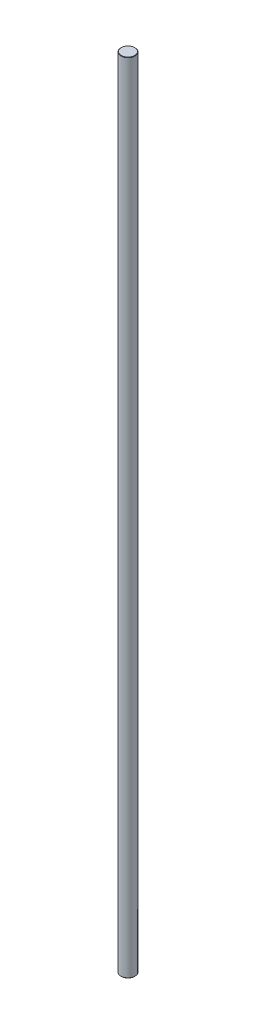
ISO-10303-21;
HEADER;
FILE_DESCRIPTION(('STEP AP214'),'2;1');
FILE_NAME('part.step','',(''),(''),'','','');
FILE_SCHEMA(('AUTOMOTIVE_DESIGN { 1 0 10303 214 1 1 1 1 }'));
ENDSEC;
DATA;
#1=APPLICATION_CONTEXT('core data for automotive mechanical design processes');
#2=APPLICATION_PROTOCOL_DEFINITION('international standard','automotive_design',2000,#1);
#3=PRODUCT_CONTEXT('',#1,'mechanical');
#4=PRODUCT('Part','Part','',(#3));
#5=PRODUCT_RELATED_PRODUCT_CATEGORY('part','',(#4));
#6=PRODUCT_DEFINITION_FORMATION('','',#4);
#7=PRODUCT_DEFINITION_CONTEXT('part definition',#1,'design');
#8=PRODUCT_DEFINITION('design','',#6,#7);
#9=PRODUCT_DEFINITION_SHAPE('','',#8);
#10=(LENGTH_UNIT() NAMED_UNIT(*) SI_UNIT(.MILLI.,.METRE.));
#11=(NAMED_UNIT(*) PLANE_ANGLE_UNIT() SI_UNIT($,.RADIAN.));
#12=(NAMED_UNIT(*) SI_UNIT($,.STERADIAN.) SOLID_ANGLE_UNIT());
#13=UNCERTAINTY_MEASURE_WITH_UNIT(LENGTH_MEASURE(1.E-05),#10,'distance_accuracy_value','');
#14=(GEOMETRIC_REPRESENTATION_CONTEXT(3) GLOBAL_UNCERTAINTY_ASSIGNED_CONTEXT((#13)) GLOBAL_UNIT_ASSIGNED_CONTEXT((#10,
#11,#12)) REPRESENTATION_CONTEXT('',''));
#15=CARTESIAN_POINT('',(0.,0.,0.));
#16=DIRECTION('',(0.,0.,1.));
#17=DIRECTION('',(1.,0.,0.));
#18=AXIS2_PLACEMENT_3D('',#15,#16,#17);
#19=CARTESIAN_POINT('',(0.,225.,0.));
#20=DIRECTION('',(0.,-1.,0.));
#21=DIRECTION('',(0.,0.,-1.));
#22=AXIS2_PLACEMENT_3D('',#19,#20,#21);
#23=CYLINDRICAL_SURFACE('',#22,4.);
#24=CARTESIAN_POINT('',(0.,-224.8,0.));
#25=DIRECTION('',(0.,1.,0.));
#26=DIRECTION('',(0.,0.,1.));
#27=AXIS2_PLACEMENT_3D('',#24,#25,#26);
#28=CIRCLE('',#27,4.);
#29=CARTESIAN_POINT('',(0.,-224.8,4.));
#30=VERTEX_POINT('',#29);
#31=EDGE_CURVE('E42',#30,#30,#28,.T.);
#32=ORIENTED_EDGE('',*,*,#31,.T.);
#33=EDGE_LOOP('',(#32));
#34=FACE_BOUND('',#33,.T.);
#35=CARTESIAN_POINT('',(0.,224.8,0.));
#36=DIRECTION('',(0.,1.,0.));
#37=DIRECTION('',(0.,0.,1.));
#38=AXIS2_PLACEMENT_3D('',#35,#36,#37);
#39=CIRCLE('',#38,4.);
#40=CARTESIAN_POINT('',(0.,224.8,4.));
#41=VERTEX_POINT('',#40);
#42=EDGE_CURVE('E46',#41,#41,#39,.F.);
#43=ORIENTED_EDGE('',*,*,#42,.T.);
#44=EDGE_LOOP('',(#43));
#45=FACE_BOUND('',#44,.T.);
#46=ADVANCED_FACE('F31',(#34,#45),#23,.T.);
#47=CARTESIAN_POINT('',(0.,225.,0.));
#48=DIRECTION('',(0.,1.,0.));
#49=DIRECTION('',(0.,0.,1.));
#50=AXIS2_PLACEMENT_3D('',#47,#48,#49);
#51=PLANE('',#50);
#52=CARTESIAN_POINT('',(0.,225.,0.));
#53=DIRECTION('',(0.,1.,0.));
#54=DIRECTION('',(0.,0.,1.));
#55=AXIS2_PLACEMENT_3D('',#52,#53,#54);
#56=CIRCLE('',#55,3.79999999999997);
#57=CARTESIAN_POINT('',(0.,225.,3.79999999999997));
#58=VERTEX_POINT('',#57);
#59=EDGE_CURVE('E10',#58,#58,#56,.T.);
#60=ORIENTED_EDGE('',*,*,#59,.T.);
#61=EDGE_LOOP('',(#60));
#62=FACE_BOUND('',#61,.T.);
#63=ADVANCED_FACE('F62',(#62),#51,.T.);
#64=CARTESIAN_POINT('',(0.,-225.,0.));
#65=DIRECTION('',(0.,1.,0.));
#66=DIRECTION('',(0.,0.,1.));
#67=AXIS2_PLACEMENT_3D('',#64,#65,#66);
#68=PLANE('',#67);
#69=CARTESIAN_POINT('',(0.,-225.,0.));
#70=DIRECTION('',(0.,1.,0.));
#71=DIRECTION('',(0.,0.,1.));
#72=AXIS2_PLACEMENT_3D('',#69,#70,#71);
#73=CIRCLE('',#72,3.80000000000008);
#74=CARTESIAN_POINT('',(0.,-225.,3.80000000000008));
#75=VERTEX_POINT('',#74);
#76=EDGE_CURVE('E38',#75,#75,#73,.F.);
#77=ORIENTED_EDGE('',*,*,#76,.T.);
#78=EDGE_LOOP('',(#77));
#79=FACE_BOUND('',#78,.T.);
#80=ADVANCED_FACE('F59',(#79),#68,.F.);
#81=CARTESIAN_POINT('',(0.,-224.8,0.));
#82=DIRECTION('',(0.,1.,0.));
#83=DIRECTION('',(0.,0.,1.));
#84=AXIS2_PLACEMENT_3D('',#81,#82,#83);
#85=CONICAL_SURFACE('',#84,4.,0.78539816339744);
#86=ORIENTED_EDGE('',*,*,#76,.F.);
#87=EDGE_LOOP('',(#86));
#88=FACE_BOUND('',#87,.T.);
#89=ORIENTED_EDGE('',*,*,#31,.F.);
#90=EDGE_LOOP('',(#89));
#91=FACE_BOUND('',#90,.T.);
#92=ADVANCED_FACE('F55',(#88,#91),#85,.T.);
#93=CARTESIAN_POINT('',(0.,225.,0.));
#94=DIRECTION('',(0.,-1.,0.));
#95=DIRECTION('',(0.,0.,-1.));
#96=AXIS2_PLACEMENT_3D('',#93,#94,#95);
#97=CONICAL_SURFACE('',#96,3.79999999999997,0.785398163397509);
#98=ORIENTED_EDGE('',*,*,#42,.F.);
#99=EDGE_LOOP('',(#98));
#100=FACE_BOUND('',#99,.T.);
#101=ORIENTED_EDGE('',*,*,#59,.F.);
#102=EDGE_LOOP('',(#101));
#103=FACE_BOUND('',#102,.T.);
#104=ADVANCED_FACE('F33',(#100,#103),#97,.T.);
#105=CLOSED_SHELL('',(#46,#63,#80,#92,#104));
#106=MANIFOLD_SOLID_BREP('B2',#105);
#107=ADVANCED_BREP_SHAPE_REPRESENTATION('',(#18,#106),#14);
#108=SHAPE_DEFINITION_REPRESENTATION(#9,#107);
ENDSEC;
END-ISO-10303-21;
